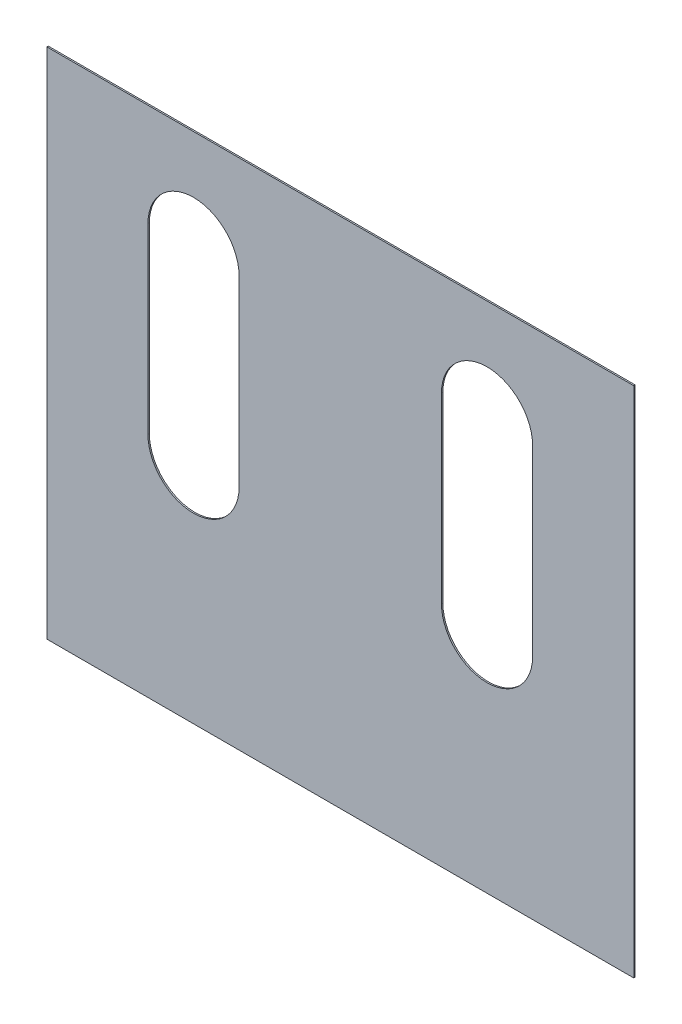
ISO-10303-21;
HEADER;
FILE_DESCRIPTION(('STEP AP214'),'2;1');
FILE_NAME('part.step','',(''),(''),'','','');
FILE_SCHEMA(('AUTOMOTIVE_DESIGN { 1 0 10303 214 1 1 1 1 }'));
ENDSEC;
DATA;
#1=APPLICATION_CONTEXT('core data for automotive mechanical design processes');
#2=APPLICATION_PROTOCOL_DEFINITION('international standard','automotive_design',2000,#1);
#3=PRODUCT_CONTEXT('',#1,'mechanical');
#4=PRODUCT('Part','Part','',(#3));
#5=PRODUCT_RELATED_PRODUCT_CATEGORY('part','',(#4));
#6=PRODUCT_DEFINITION_FORMATION('','',#4);
#7=PRODUCT_DEFINITION_CONTEXT('part definition',#1,'design');
#8=PRODUCT_DEFINITION('design','',#6,#7);
#9=PRODUCT_DEFINITION_SHAPE('','',#8);
#10=(LENGTH_UNIT() NAMED_UNIT(*) SI_UNIT(.MILLI.,.METRE.));
#11=(NAMED_UNIT(*) PLANE_ANGLE_UNIT() SI_UNIT($,.RADIAN.));
#12=(NAMED_UNIT(*) SI_UNIT($,.STERADIAN.) SOLID_ANGLE_UNIT());
#13=UNCERTAINTY_MEASURE_WITH_UNIT(LENGTH_MEASURE(1.E-05),#10,'distance_accuracy_value','');
#14=(GEOMETRIC_REPRESENTATION_CONTEXT(3) GLOBAL_UNCERTAINTY_ASSIGNED_CONTEXT((#13)) GLOBAL_UNIT_ASSIGNED_CONTEXT((#10,
#11,#12)) REPRESENTATION_CONTEXT('',''));
#15=CARTESIAN_POINT('',(0.,0.,0.));
#16=DIRECTION('',(0.,0.,1.));
#17=DIRECTION('',(1.,0.,0.));
#18=AXIS2_PLACEMENT_3D('',#15,#16,#17);
#19=CARTESIAN_POINT('',(0.,0.,6.35));
#20=DIRECTION('',(0.,0.,-1.));
#21=DIRECTION('',(-1.,0.,0.));
#22=AXIS2_PLACEMENT_3D('',#19,#20,#21);
#23=PLANE('',#22);
#24=CARTESIAN_POINT('',(-654.05,685.8,6.35));
#25=DIRECTION('',(0.,0.,1.));
#26=DIRECTION('',(1.,0.,0.));
#27=AXIS2_PLACEMENT_3D('',#24,#25,#26);
#28=CIRCLE('',#27,203.2);
#29=CARTESIAN_POINT('',(-450.85,685.8,6.35));
#30=VERTEX_POINT('',#29);
#31=CARTESIAN_POINT('',(-857.25,685.8,6.35));
#32=VERTEX_POINT('',#31);
#33=EDGE_CURVE('E160',#30,#32,#28,.T.);
#34=ORIENTED_EDGE('',*,*,#33,.F.);
#35=DIRECTION('',(0.,1.,0.));
#36=VECTOR('',#35,1.);
#37=CARTESIAN_POINT('',(-450.85,685.8,6.35));
#38=LINE('',#37,#36);
#39=CARTESIAN_POINT('',(-450.85,-127.,6.35));
#40=VERTEX_POINT('',#39);
#41=EDGE_CURVE('E168',#40,#30,#38,.T.);
#42=ORIENTED_EDGE('',*,*,#41,.F.);
#43=CARTESIAN_POINT('',(-654.05,-127.,6.35));
#44=DIRECTION('',(0.,0.,1.));
#45=DIRECTION('',(1.,0.,0.));
#46=AXIS2_PLACEMENT_3D('',#43,#44,#45);
#47=CIRCLE('',#46,203.2);
#48=CARTESIAN_POINT('',(-857.25,-127.,6.35));
#49=VERTEX_POINT('',#48);
#50=EDGE_CURVE('E165',#49,#40,#47,.T.);
#51=ORIENTED_EDGE('',*,*,#50,.F.);
#52=DIRECTION('',(0.,-1.,0.));
#53=VECTOR('',#52,1.);
#54=CARTESIAN_POINT('',(-857.25,685.8,6.35));
#55=LINE('',#54,#53);
#56=EDGE_CURVE('E162',#32,#49,#55,.T.);
#57=ORIENTED_EDGE('',*,*,#56,.F.);
#58=EDGE_LOOP('',(#34,#42,#51,#57));
#59=FACE_BOUND('',#58,.T.);
#60=DIRECTION('',(0.,1.,0.));
#61=VECTOR('',#60,1.);
#62=CARTESIAN_POINT('',(1308.1,-1143.,6.35));
#63=LINE('',#62,#61);
#64=CARTESIAN_POINT('',(1308.1,-1143.,6.35));
#65=VERTEX_POINT('',#64);
#66=CARTESIAN_POINT('',(1308.1,1143.,6.35));
#67=VERTEX_POINT('',#66);
#68=EDGE_CURVE('E191',#65,#67,#63,.T.);
#69=ORIENTED_EDGE('',*,*,#68,.T.);
#70=DIRECTION('',(-1.,0.,0.));
#71=VECTOR('',#70,1.);
#72=CARTESIAN_POINT('',(-1308.1,1143.,6.35));
#73=LINE('',#72,#71);
#74=CARTESIAN_POINT('',(-1308.1,1143.,6.35));
#75=VERTEX_POINT('',#74);
#76=EDGE_CURVE('E194',#67,#75,#73,.T.);
#77=ORIENTED_EDGE('',*,*,#76,.T.);
#78=DIRECTION('',(0.,-1.,0.));
#79=VECTOR('',#78,1.);
#80=CARTESIAN_POINT('',(-1308.1,-1143.,6.35));
#81=LINE('',#80,#79);
#82=CARTESIAN_POINT('',(-1308.1,-1143.,6.35));
#83=VERTEX_POINT('',#82);
#84=EDGE_CURVE('E197',#75,#83,#81,.T.);
#85=ORIENTED_EDGE('',*,*,#84,.T.);
#86=DIRECTION('',(1.,0.,0.));
#87=VECTOR('',#86,1.);
#88=CARTESIAN_POINT('',(-1308.1,-1143.,6.35));
#89=LINE('',#88,#87);
#90=EDGE_CURVE('E199',#83,#65,#89,.T.);
#91=ORIENTED_EDGE('',*,*,#90,.T.);
#92=EDGE_LOOP('',(#69,#77,#85,#91));
#93=FACE_BOUND('',#92,.T.);
#94=CARTESIAN_POINT('',(654.05,685.8,6.35));
#95=DIRECTION('',(0.,0.,1.));
#96=DIRECTION('',(1.,0.,0.));
#97=AXIS2_PLACEMENT_3D('',#94,#95,#96);
#98=CIRCLE('',#97,203.2);
#99=CARTESIAN_POINT('',(857.25,685.8,6.35));
#100=VERTEX_POINT('',#99);
#101=CARTESIAN_POINT('',(450.85,685.8,6.35));
#102=VERTEX_POINT('',#101);
#103=EDGE_CURVE('E124',#100,#102,#98,.T.);
#104=ORIENTED_EDGE('',*,*,#103,.F.);
#105=DIRECTION('',(0.,1.,0.));
#106=VECTOR('',#105,1.);
#107=CARTESIAN_POINT('',(857.25,685.8,6.35));
#108=LINE('',#107,#106);
#109=CARTESIAN_POINT('',(857.25,-127.,6.35));
#110=VERTEX_POINT('',#109);
#111=EDGE_CURVE('E146',#110,#100,#108,.T.);
#112=ORIENTED_EDGE('',*,*,#111,.F.);
#113=CARTESIAN_POINT('',(654.05,-127.,6.35));
#114=DIRECTION('',(0.,0.,1.));
#115=DIRECTION('',(1.,0.,0.));
#116=AXIS2_PLACEMENT_3D('',#113,#114,#115);
#117=CIRCLE('',#116,203.2);
#118=CARTESIAN_POINT('',(450.85,-127.,6.35));
#119=VERTEX_POINT('',#118);
#120=EDGE_CURVE('E144',#119,#110,#117,.T.);
#121=ORIENTED_EDGE('',*,*,#120,.F.);
#122=DIRECTION('',(0.,-1.,0.));
#123=VECTOR('',#122,1.);
#124=CARTESIAN_POINT('',(450.85,685.8,6.35));
#125=LINE('',#124,#123);
#126=EDGE_CURVE('E132',#102,#119,#125,.T.);
#127=ORIENTED_EDGE('',*,*,#126,.F.);
#128=EDGE_LOOP('',(#104,#112,#121,#127));
#129=FACE_BOUND('',#128,.T.);
#130=ADVANCED_FACE('F35',(#59,#93,#129),#23,.F.);
#131=CARTESIAN_POINT('',(0.,0.,0.));
#132=DIRECTION('',(0.,0.,-1.));
#133=DIRECTION('',(-1.,0.,0.));
#134=AXIS2_PLACEMENT_3D('',#131,#132,#133);
#135=PLANE('',#134);
#136=DIRECTION('',(0.,1.,0.));
#137=VECTOR('',#136,1.);
#138=CARTESIAN_POINT('',(1308.1,-1143.,0.));
#139=LINE('',#138,#137);
#140=CARTESIAN_POINT('',(1308.1,-1143.,0.));
#141=VERTEX_POINT('',#140);
#142=CARTESIAN_POINT('',(1308.1,1143.,0.));
#143=VERTEX_POINT('',#142);
#144=EDGE_CURVE('E190',#141,#143,#139,.T.);
#145=ORIENTED_EDGE('',*,*,#144,.F.);
#146=DIRECTION('',(1.,0.,0.));
#147=VECTOR('',#146,1.);
#148=CARTESIAN_POINT('',(-1308.1,-1143.,0.));
#149=LINE('',#148,#147);
#150=CARTESIAN_POINT('',(-1308.1,-1143.,0.));
#151=VERTEX_POINT('',#150);
#152=EDGE_CURVE('E195',#151,#141,#149,.T.);
#153=ORIENTED_EDGE('',*,*,#152,.F.);
#154=DIRECTION('',(0.,-1.,0.));
#155=VECTOR('',#154,1.);
#156=CARTESIAN_POINT('',(-1308.1,-1143.,0.));
#157=LINE('',#156,#155);
#158=CARTESIAN_POINT('',(-1308.1,1143.,0.));
#159=VERTEX_POINT('',#158);
#160=EDGE_CURVE('E206',#159,#151,#157,.T.);
#161=ORIENTED_EDGE('',*,*,#160,.F.);
#162=DIRECTION('',(-1.,0.,0.));
#163=VECTOR('',#162,1.);
#164=CARTESIAN_POINT('',(-1308.1,1143.,0.));
#165=LINE('',#164,#163);
#166=EDGE_CURVE('E204',#143,#159,#165,.T.);
#167=ORIENTED_EDGE('',*,*,#166,.F.);
#168=EDGE_LOOP('',(#145,#153,#161,#167));
#169=FACE_BOUND('',#168,.T.);
#170=DIRECTION('',(0.,1.,0.));
#171=VECTOR('',#170,1.);
#172=CARTESIAN_POINT('',(-450.85,685.8,0.));
#173=LINE('',#172,#171);
#174=CARTESIAN_POINT('',(-450.85,-127.,0.));
#175=VERTEX_POINT('',#174);
#176=CARTESIAN_POINT('',(-450.85,685.8,0.));
#177=VERTEX_POINT('',#176);
#178=EDGE_CURVE('E163',#175,#177,#173,.T.);
#179=ORIENTED_EDGE('',*,*,#178,.T.);
#180=CARTESIAN_POINT('',(-654.05,685.8,0.));
#181=DIRECTION('',(0.,0.,1.));
#182=DIRECTION('',(1.,0.,0.));
#183=AXIS2_PLACEMENT_3D('',#180,#181,#182);
#184=CIRCLE('',#183,203.2);
#185=CARTESIAN_POINT('',(-857.25,685.8,0.));
#186=VERTEX_POINT('',#185);
#187=EDGE_CURVE('E140',#177,#186,#184,.T.);
#188=ORIENTED_EDGE('',*,*,#187,.T.);
#189=DIRECTION('',(0.,-1.,0.));
#190=VECTOR('',#189,1.);
#191=CARTESIAN_POINT('',(-857.25,685.8,0.));
#192=LINE('',#191,#190);
#193=CARTESIAN_POINT('',(-857.25,-127.,0.));
#194=VERTEX_POINT('',#193);
#195=EDGE_CURVE('E173',#186,#194,#192,.T.);
#196=ORIENTED_EDGE('',*,*,#195,.T.);
#197=CARTESIAN_POINT('',(-654.05,-127.,0.));
#198=DIRECTION('',(0.,0.,1.));
#199=DIRECTION('',(1.,0.,0.));
#200=AXIS2_PLACEMENT_3D('',#197,#198,#199);
#201=CIRCLE('',#200,203.2);
#202=EDGE_CURVE('E176',#194,#175,#201,.T.);
#203=ORIENTED_EDGE('',*,*,#202,.T.);
#204=EDGE_LOOP('',(#179,#188,#196,#203));
#205=FACE_BOUND('',#204,.T.);
#206=DIRECTION('',(0.,1.,0.));
#207=VECTOR('',#206,1.);
#208=CARTESIAN_POINT('',(857.25,685.8,0.));
#209=LINE('',#208,#207);
#210=CARTESIAN_POINT('',(857.25,-127.,0.));
#211=VERTEX_POINT('',#210);
#212=CARTESIAN_POINT('',(857.25,685.8,0.));
#213=VERTEX_POINT('',#212);
#214=EDGE_CURVE('E133',#211,#213,#209,.T.);
#215=ORIENTED_EDGE('',*,*,#214,.T.);
#216=CARTESIAN_POINT('',(654.05,685.8,0.));
#217=DIRECTION('',(0.,0.,1.));
#218=DIRECTION('',(1.,0.,0.));
#219=AXIS2_PLACEMENT_3D('',#216,#217,#218);
#220=CIRCLE('',#219,203.2);
#221=CARTESIAN_POINT('',(450.85,685.8,0.));
#222=VERTEX_POINT('',#221);
#223=EDGE_CURVE('E58',#213,#222,#220,.T.);
#224=ORIENTED_EDGE('',*,*,#223,.T.);
#225=DIRECTION('',(0.,-1.,0.));
#226=VECTOR('',#225,1.);
#227=CARTESIAN_POINT('',(450.85,685.8,0.));
#228=LINE('',#227,#226);
#229=CARTESIAN_POINT('',(450.85,-127.,0.));
#230=VERTEX_POINT('',#229);
#231=EDGE_CURVE('E139',#222,#230,#228,.T.);
#232=ORIENTED_EDGE('',*,*,#231,.T.);
#233=CARTESIAN_POINT('',(654.05,-127.,0.));
#234=DIRECTION('',(0.,0.,1.));
#235=DIRECTION('',(1.,0.,0.));
#236=AXIS2_PLACEMENT_3D('',#233,#234,#235);
#237=CIRCLE('',#236,203.2);
#238=EDGE_CURVE('E152',#230,#211,#237,.T.);
#239=ORIENTED_EDGE('',*,*,#238,.T.);
#240=EDGE_LOOP('',(#215,#224,#232,#239));
#241=FACE_BOUND('',#240,.T.);
#242=ADVANCED_FACE('F224',(#169,#205,#241),#135,.T.);
#243=CARTESIAN_POINT('',(1308.1,-1143.,6.35));
#244=DIRECTION('',(-1.,0.,0.));
#245=DIRECTION('',(0.,0.,1.));
#246=AXIS2_PLACEMENT_3D('',#243,#244,#245);
#247=PLANE('',#246);
#248=ORIENTED_EDGE('',*,*,#144,.T.);
#249=DIRECTION('',(0.,0.,-1.));
#250=VECTOR('',#249,1.);
#251=CARTESIAN_POINT('',(1308.1,1143.,6.35));
#252=LINE('',#251,#250);
#253=EDGE_CURVE('E11',#67,#143,#252,.T.);
#254=ORIENTED_EDGE('',*,*,#253,.F.);
#255=ORIENTED_EDGE('',*,*,#68,.F.);
#256=DIRECTION('',(0.,0.,-1.));
#257=VECTOR('',#256,1.);
#258=CARTESIAN_POINT('',(1308.1,-1143.,6.35));
#259=LINE('',#258,#257);
#260=EDGE_CURVE('E201',#65,#141,#259,.T.);
#261=ORIENTED_EDGE('',*,*,#260,.T.);
#262=EDGE_LOOP('',(#248,#254,#255,#261));
#263=FACE_BOUND('',#262,.T.);
#264=ADVANCED_FACE('F37',(#263),#247,.F.);
#265=CARTESIAN_POINT('',(-1308.1,1143.,6.35));
#266=DIRECTION('',(0.,-1.,0.));
#267=DIRECTION('',(0.,0.,-1.));
#268=AXIS2_PLACEMENT_3D('',#265,#266,#267);
#269=PLANE('',#268);
#270=ORIENTED_EDGE('',*,*,#166,.T.);
#271=DIRECTION('',(0.,0.,-1.));
#272=VECTOR('',#271,1.);
#273=CARTESIAN_POINT('',(-1308.1,1143.,6.35));
#274=LINE('',#273,#272);
#275=EDGE_CURVE('E43',#75,#159,#274,.T.);
#276=ORIENTED_EDGE('',*,*,#275,.F.);
#277=ORIENTED_EDGE('',*,*,#76,.F.);
#278=ORIENTED_EDGE('',*,*,#253,.T.);
#279=EDGE_LOOP('',(#270,#276,#277,#278));
#280=FACE_BOUND('',#279,.T.);
#281=ADVANCED_FACE('F234',(#280),#269,.F.);
#282=CARTESIAN_POINT('',(-1308.1,-1143.,6.35));
#283=DIRECTION('',(1.,0.,0.));
#284=DIRECTION('',(0.,0.,-1.));
#285=AXIS2_PLACEMENT_3D('',#282,#283,#284);
#286=PLANE('',#285);
#287=ORIENTED_EDGE('',*,*,#160,.T.);
#288=DIRECTION('',(0.,0.,-1.));
#289=VECTOR('',#288,1.);
#290=CARTESIAN_POINT('',(-1308.1,-1143.,6.35));
#291=LINE('',#290,#289);
#292=EDGE_CURVE('E211',#83,#151,#291,.T.);
#293=ORIENTED_EDGE('',*,*,#292,.F.);
#294=ORIENTED_EDGE('',*,*,#84,.F.);
#295=ORIENTED_EDGE('',*,*,#275,.T.);
#296=EDGE_LOOP('',(#287,#293,#294,#295));
#297=FACE_BOUND('',#296,.T.);
#298=ADVANCED_FACE('F218',(#297),#286,.F.);
#299=CARTESIAN_POINT('',(-1308.1,-1143.,6.35));
#300=DIRECTION('',(0.,1.,0.));
#301=DIRECTION('',(0.,0.,1.));
#302=AXIS2_PLACEMENT_3D('',#299,#300,#301);
#303=PLANE('',#302);
#304=ORIENTED_EDGE('',*,*,#152,.T.);
#305=ORIENTED_EDGE('',*,*,#260,.F.);
#306=ORIENTED_EDGE('',*,*,#90,.F.);
#307=ORIENTED_EDGE('',*,*,#292,.T.);
#308=EDGE_LOOP('',(#304,#305,#306,#307));
#309=FACE_BOUND('',#308,.T.);
#310=ADVANCED_FACE('F228',(#309),#303,.F.);
#311=CARTESIAN_POINT('',(-654.05,685.8,6.35));
#312=DIRECTION('',(0.,0.,-1.));
#313=DIRECTION('',(-1.,0.,0.));
#314=AXIS2_PLACEMENT_3D('',#311,#312,#313);
#315=CYLINDRICAL_SURFACE('',#314,203.2);
#316=ORIENTED_EDGE('',*,*,#187,.F.);
#317=DIRECTION('',(0.,0.,-1.));
#318=VECTOR('',#317,1.);
#319=CARTESIAN_POINT('',(-450.85,685.8,6.35));
#320=LINE('',#319,#318);
#321=EDGE_CURVE('E170',#30,#177,#320,.T.);
#322=ORIENTED_EDGE('',*,*,#321,.F.);
#323=ORIENTED_EDGE('',*,*,#33,.T.);
#324=DIRECTION('',(0.,0.,-1.));
#325=VECTOR('',#324,1.);
#326=CARTESIAN_POINT('',(-857.25,685.8,6.35));
#327=LINE('',#326,#325);
#328=EDGE_CURVE('E187',#32,#186,#327,.T.);
#329=ORIENTED_EDGE('',*,*,#328,.T.);
#330=EDGE_LOOP('',(#316,#322,#323,#329));
#331=FACE_BOUND('',#330,.T.);
#332=ADVANCED_FACE('F250',(#331),#315,.F.);
#333=CARTESIAN_POINT('',(-857.25,685.8,6.35));
#334=DIRECTION('',(1.,0.,0.));
#335=DIRECTION('',(0.,0.,-1.));
#336=AXIS2_PLACEMENT_3D('',#333,#334,#335);
#337=PLANE('',#336);
#338=ORIENTED_EDGE('',*,*,#195,.F.);
#339=ORIENTED_EDGE('',*,*,#328,.F.);
#340=ORIENTED_EDGE('',*,*,#56,.T.);
#341=DIRECTION('',(0.,0.,-1.));
#342=VECTOR('',#341,1.);
#343=CARTESIAN_POINT('',(-857.25,-127.,6.35));
#344=LINE('',#343,#342);
#345=EDGE_CURVE('E185',#49,#194,#344,.T.);
#346=ORIENTED_EDGE('',*,*,#345,.T.);
#347=EDGE_LOOP('',(#338,#339,#340,#346));
#348=FACE_BOUND('',#347,.T.);
#349=ADVANCED_FACE('F257',(#348),#337,.T.);
#350=CARTESIAN_POINT('',(-654.05,-127.,6.35));
#351=DIRECTION('',(0.,0.,-1.));
#352=DIRECTION('',(-1.,0.,0.));
#353=AXIS2_PLACEMENT_3D('',#350,#351,#352);
#354=CYLINDRICAL_SURFACE('',#353,203.2);
#355=ORIENTED_EDGE('',*,*,#202,.F.);
#356=ORIENTED_EDGE('',*,*,#345,.F.);
#357=ORIENTED_EDGE('',*,*,#50,.T.);
#358=DIRECTION('',(0.,0.,-1.));
#359=VECTOR('',#358,1.);
#360=CARTESIAN_POINT('',(-450.85,-127.,6.35));
#361=LINE('',#360,#359);
#362=EDGE_CURVE('E183',#40,#175,#361,.T.);
#363=ORIENTED_EDGE('',*,*,#362,.T.);
#364=EDGE_LOOP('',(#355,#356,#357,#363));
#365=FACE_BOUND('',#364,.T.);
#366=ADVANCED_FACE('F262',(#365),#354,.F.);
#367=CARTESIAN_POINT('',(-450.85,685.8,6.35));
#368=DIRECTION('',(-1.,0.,0.));
#369=DIRECTION('',(0.,-1.,0.));
#370=AXIS2_PLACEMENT_3D('',#367,#368,#369);
#371=PLANE('',#370);
#372=ORIENTED_EDGE('',*,*,#178,.F.);
#373=ORIENTED_EDGE('',*,*,#362,.F.);
#374=ORIENTED_EDGE('',*,*,#41,.T.);
#375=ORIENTED_EDGE('',*,*,#321,.T.);
#376=EDGE_LOOP('',(#372,#373,#374,#375));
#377=FACE_BOUND('',#376,.T.);
#378=ADVANCED_FACE('F268',(#377),#371,.T.);
#379=CARTESIAN_POINT('',(654.05,685.8,6.35));
#380=DIRECTION('',(0.,0.,-1.));
#381=DIRECTION('',(-1.,0.,0.));
#382=AXIS2_PLACEMENT_3D('',#379,#380,#381);
#383=CYLINDRICAL_SURFACE('',#382,203.2);
#384=ORIENTED_EDGE('',*,*,#223,.F.);
#385=DIRECTION('',(0.,0.,-1.));
#386=VECTOR('',#385,1.);
#387=CARTESIAN_POINT('',(857.25,685.8,6.35));
#388=LINE('',#387,#386);
#389=EDGE_CURVE('E128',#100,#213,#388,.T.);
#390=ORIENTED_EDGE('',*,*,#389,.F.);
#391=ORIENTED_EDGE('',*,*,#103,.T.);
#392=DIRECTION('',(0.,0.,-1.));
#393=VECTOR('',#392,1.);
#394=CARTESIAN_POINT('',(450.85,685.8,6.35));
#395=LINE('',#394,#393);
#396=EDGE_CURVE('E127',#102,#222,#395,.T.);
#397=ORIENTED_EDGE('',*,*,#396,.T.);
#398=EDGE_LOOP('',(#384,#390,#391,#397));
#399=FACE_BOUND('',#398,.T.);
#400=ADVANCED_FACE('F126',(#399),#383,.F.);
#401=CARTESIAN_POINT('',(450.85,685.8,6.35));
#402=DIRECTION('',(1.,0.,0.));
#403=DIRECTION('',(0.,1.,0.));
#404=AXIS2_PLACEMENT_3D('',#401,#402,#403);
#405=PLANE('',#404);
#406=ORIENTED_EDGE('',*,*,#231,.F.);
#407=ORIENTED_EDGE('',*,*,#396,.F.);
#408=ORIENTED_EDGE('',*,*,#126,.T.);
#409=DIRECTION('',(0.,0.,-1.));
#410=VECTOR('',#409,1.);
#411=CARTESIAN_POINT('',(450.85,-127.,6.35));
#412=LINE('',#411,#410);
#413=EDGE_CURVE('E141',#119,#230,#412,.T.);
#414=ORIENTED_EDGE('',*,*,#413,.T.);
#415=EDGE_LOOP('',(#406,#407,#408,#414));
#416=FACE_BOUND('',#415,.T.);
#417=ADVANCED_FACE('F136',(#416),#405,.T.);
#418=CARTESIAN_POINT('',(654.05,-127.,6.35));
#419=DIRECTION('',(0.,0.,-1.));
#420=DIRECTION('',(-1.,0.,0.));
#421=AXIS2_PLACEMENT_3D('',#418,#419,#420);
#422=CYLINDRICAL_SURFACE('',#421,203.2);
#423=ORIENTED_EDGE('',*,*,#238,.F.);
#424=ORIENTED_EDGE('',*,*,#413,.F.);
#425=ORIENTED_EDGE('',*,*,#120,.T.);
#426=DIRECTION('',(0.,0.,-1.));
#427=VECTOR('',#426,1.);
#428=CARTESIAN_POINT('',(857.25,-127.,6.35));
#429=LINE('',#428,#427);
#430=EDGE_CURVE('E50',#110,#211,#429,.T.);
#431=ORIENTED_EDGE('',*,*,#430,.T.);
#432=EDGE_LOOP('',(#423,#424,#425,#431));
#433=FACE_BOUND('',#432,.T.);
#434=ADVANCED_FACE('F287',(#433),#422,.F.);
#435=CARTESIAN_POINT('',(857.25,685.8,6.35));
#436=DIRECTION('',(-1.,0.,0.));
#437=DIRECTION('',(0.,-1.,0.));
#438=AXIS2_PLACEMENT_3D('',#435,#436,#437);
#439=PLANE('',#438);
#440=ORIENTED_EDGE('',*,*,#214,.F.);
#441=ORIENTED_EDGE('',*,*,#430,.F.);
#442=ORIENTED_EDGE('',*,*,#111,.T.);
#443=ORIENTED_EDGE('',*,*,#389,.T.);
#444=EDGE_LOOP('',(#440,#441,#442,#443));
#445=FACE_BOUND('',#444,.T.);
#446=ADVANCED_FACE('F290',(#445),#439,.T.);
#447=CLOSED_SHELL('',(#130,#242,#264,#281,#298,#310,#332,#349,#366,#378,#400,#417,#434,#446));
#448=MANIFOLD_SOLID_BREP('B2',#447);
#449=ADVANCED_BREP_SHAPE_REPRESENTATION('',(#18,#448),#14);
#450=SHAPE_DEFINITION_REPRESENTATION(#9,#449);
ENDSEC;
END-ISO-10303-21;
